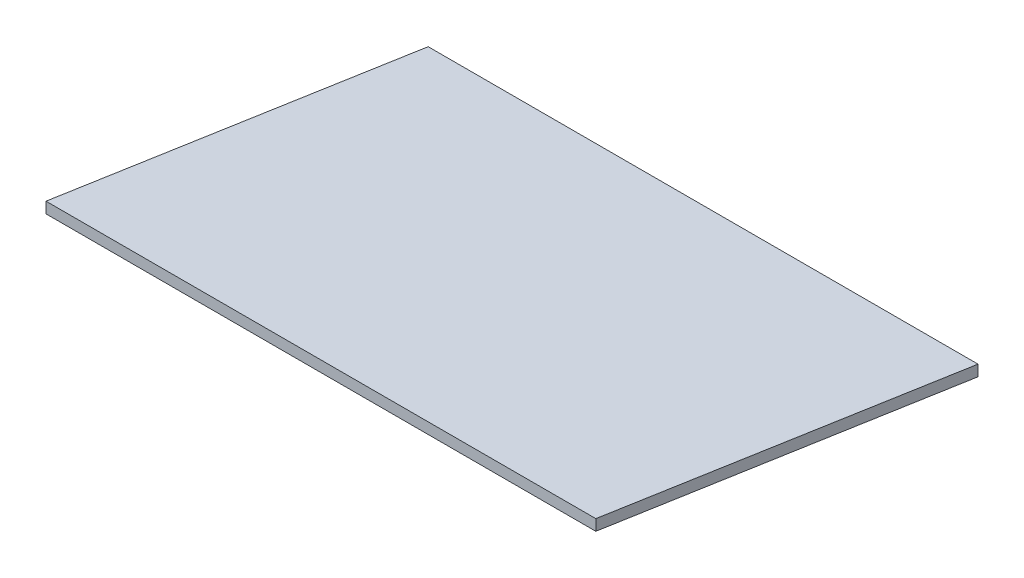
ISO-10303-21;
HEADER;
FILE_DESCRIPTION(('STEP AP214'),'2;1');
FILE_NAME('part.step','',(''),(''),'','','');
FILE_SCHEMA(('AUTOMOTIVE_DESIGN { 1 0 10303 214 1 1 1 1 }'));
ENDSEC;
DATA;
#1=APPLICATION_CONTEXT('core data for automotive mechanical design processes');
#2=APPLICATION_PROTOCOL_DEFINITION('international standard','automotive_design',2000,#1);
#3=PRODUCT_CONTEXT('',#1,'mechanical');
#4=PRODUCT('Part','Part','',(#3));
#5=PRODUCT_RELATED_PRODUCT_CATEGORY('part','',(#4));
#6=PRODUCT_DEFINITION_FORMATION('','',#4);
#7=PRODUCT_DEFINITION_CONTEXT('part definition',#1,'design');
#8=PRODUCT_DEFINITION('design','',#6,#7);
#9=PRODUCT_DEFINITION_SHAPE('','',#8);
#10=(LENGTH_UNIT() NAMED_UNIT(*) SI_UNIT(.MILLI.,.METRE.));
#11=(NAMED_UNIT(*) PLANE_ANGLE_UNIT() SI_UNIT($,.RADIAN.));
#12=(NAMED_UNIT(*) SI_UNIT($,.STERADIAN.) SOLID_ANGLE_UNIT());
#13=UNCERTAINTY_MEASURE_WITH_UNIT(LENGTH_MEASURE(1.E-05),#10,'distance_accuracy_value','');
#14=(GEOMETRIC_REPRESENTATION_CONTEXT(3) GLOBAL_UNCERTAINTY_ASSIGNED_CONTEXT((#13)) GLOBAL_UNIT_ASSIGNED_CONTEXT((#10,
#11,#12)) REPRESENTATION_CONTEXT('',''));
#15=CARTESIAN_POINT('',(0.,0.,0.));
#16=DIRECTION('',(0.,0.,1.));
#17=DIRECTION('',(1.,0.,0.));
#18=AXIS2_PLACEMENT_3D('',#15,#16,#17);
#19=CARTESIAN_POINT('',(0.,20.,0.));
#20=DIRECTION('',(0.,0.,-1.));
#21=DIRECTION('',(-1.,0.,0.));
#22=AXIS2_PLACEMENT_3D('',#19,#20,#21);
#23=PLANE('',#22);
#24=CARTESIAN_POINT('',(0.,0.,0.));
#25=CARTESIAN_POINT('',(200.,0.,0.));
#26=CARTESIAN_POINT('',(800.,0.,0.));
#27=CARTESIAN_POINT('',(1000.,0.,0.));
#28=B_SPLINE_CURVE_WITH_KNOTS('',3,(#24,#25,#26,#27),.UNSPECIFIED.,.F.,.F.,(4,4),(0.,1.),.UNSPECIFIED.);
#29=CARTESIAN_POINT('',(0.,0.,0.));
#30=VERTEX_POINT('',#29);
#31=CARTESIAN_POINT('',(1000.,0.,0.));
#32=VERTEX_POINT('',#31);
#33=EDGE_CURVE('E107',#30,#32,#28,.T.);
#34=ORIENTED_EDGE('',*,*,#33,.T.);
#35=DIRECTION('',(0.,-1.,0.));
#36=VECTOR('',#35,1.);
#37=CARTESIAN_POINT('',(1000.,20.,0.));
#38=LINE('',#37,#36);
#39=CARTESIAN_POINT('',(1000.,20.,0.));
#40=VERTEX_POINT('',#39);
#41=EDGE_CURVE('E11',#40,#32,#38,.T.);
#42=ORIENTED_EDGE('',*,*,#41,.F.);
#43=CARTESIAN_POINT('',(0.,20.,0.));
#44=CARTESIAN_POINT('',(200.,20.,0.));
#45=CARTESIAN_POINT('',(800.,20.,0.));
#46=CARTESIAN_POINT('',(1000.,20.,0.));
#47=B_SPLINE_CURVE_WITH_KNOTS('',3,(#43,#44,#45,#46),.UNSPECIFIED.,.F.,.F.,(4,4),(0.,1.),.UNSPECIFIED.);
#48=CARTESIAN_POINT('',(0.,20.,0.));
#49=VERTEX_POINT('',#48);
#50=EDGE_CURVE('E86',#49,#40,#47,.T.);
#51=ORIENTED_EDGE('',*,*,#50,.F.);
#52=DIRECTION('',(0.,-1.,0.));
#53=VECTOR('',#52,1.);
#54=CARTESIAN_POINT('',(0.,20.,0.));
#55=LINE('',#54,#53);
#56=EDGE_CURVE('E94',#49,#30,#55,.T.);
#57=ORIENTED_EDGE('',*,*,#56,.T.);
#58=EDGE_LOOP('',(#34,#42,#51,#57));
#59=FACE_BOUND('',#58,.T.);
#60=ADVANCED_FACE('F35',(#59),#23,.F.);
#61=CARTESIAN_POINT('',(1000.,20.,0.));
#62=DIRECTION('',(-0.984807753012209,0.,-0.173648177666927));
#63=DIRECTION('',(-0.173648177666927,0.,0.984807753012209));
#64=AXIS2_PLACEMENT_3D('',#61,#62,#63);
#65=PLANE('',#64);
#66=CARTESIAN_POINT('',(1000.,0.,0.));
#67=CARTESIAN_POINT('',(1104.18890660016,0.,-590.884651807325));
#68=B_SPLINE_CURVE_WITH_KNOTS('',1,(#66,#67),.UNSPECIFIED.,.F.,.F.,(2,2),(0.,1.),.UNSPECIFIED.);
#69=CARTESIAN_POINT('',(1104.18890660016,0.,-590.884651807325));
#70=VERTEX_POINT('',#69);
#71=EDGE_CURVE('E90',#32,#70,#68,.T.);
#72=ORIENTED_EDGE('',*,*,#71,.T.);
#73=DIRECTION('',(0.,-1.,0.));
#74=VECTOR('',#73,1.);
#75=CARTESIAN_POINT('',(1104.18890660016,20.,-590.884651807325));
#76=LINE('',#75,#74);
#77=CARTESIAN_POINT('',(1104.18890660016,20.,-590.884651807325));
#78=VERTEX_POINT('',#77);
#79=EDGE_CURVE('E43',#78,#70,#76,.T.);
#80=ORIENTED_EDGE('',*,*,#79,.F.);
#81=CARTESIAN_POINT('',(1000.,20.,0.));
#82=CARTESIAN_POINT('',(1104.18890660016,20.,-590.884651807325));
#83=B_SPLINE_CURVE_WITH_KNOTS('',1,(#81,#82),.UNSPECIFIED.,.F.,.F.,(2,2),(0.,1.),.UNSPECIFIED.);
#84=EDGE_CURVE('E81',#40,#78,#83,.T.);
#85=ORIENTED_EDGE('',*,*,#84,.F.);
#86=ORIENTED_EDGE('',*,*,#41,.T.);
#87=EDGE_LOOP('',(#72,#80,#85,#86));
#88=FACE_BOUND('',#87,.T.);
#89=ADVANCED_FACE('F89',(#88),#65,.F.);
#90=CARTESIAN_POINT('',(1104.18890660016,20.,-590.884651807325));
#91=DIRECTION('',(0.,0.,1.));
#92=DIRECTION('',(1.,0.,0.));
#93=AXIS2_PLACEMENT_3D('',#90,#91,#92);
#94=PLANE('',#93);
#95=CARTESIAN_POINT('',(1104.18890660016,0.,-590.884651807325));
#96=CARTESIAN_POINT('',(804.188906600156,0.,-590.884651807325));
#97=CARTESIAN_POINT('',(104.188906600156,0.,-590.884651807325));
#98=B_SPLINE_CURVE_WITH_KNOTS('',2,(#95,#96,#97),.UNSPECIFIED.,.F.,.F.,(3,3),(0.,1.),.UNSPECIFIED.);
#99=CARTESIAN_POINT('',(104.188906600156,0.,-590.884651807325));
#100=VERTEX_POINT('',#99);
#101=EDGE_CURVE('E68',#70,#100,#98,.T.);
#102=ORIENTED_EDGE('',*,*,#101,.T.);
#103=DIRECTION('',(0.,-1.,0.));
#104=VECTOR('',#103,1.);
#105=CARTESIAN_POINT('',(104.188906600156,20.,-590.884651807325));
#106=LINE('',#105,#104);
#107=CARTESIAN_POINT('',(104.188906600156,20.,-590.884651807325));
#108=VERTEX_POINT('',#107);
#109=EDGE_CURVE('E91',#108,#100,#106,.T.);
#110=ORIENTED_EDGE('',*,*,#109,.F.);
#111=CARTESIAN_POINT('',(1104.18890660016,20.,-590.884651807325));
#112=CARTESIAN_POINT('',(804.188906600156,20.,-590.884651807325));
#113=CARTESIAN_POINT('',(104.188906600156,20.,-590.884651807325));
#114=B_SPLINE_CURVE_WITH_KNOTS('',2,(#111,#112,#113),.UNSPECIFIED.,.F.,.F.,(3,3),(0.,1.),.UNSPECIFIED.);
#115=EDGE_CURVE('E84',#78,#108,#114,.T.);
#116=ORIENTED_EDGE('',*,*,#115,.F.);
#117=ORIENTED_EDGE('',*,*,#79,.T.);
#118=EDGE_LOOP('',(#102,#110,#116,#117));
#119=FACE_BOUND('',#118,.T.);
#120=ADVANCED_FACE('F92',(#119),#94,.F.);
#121=CARTESIAN_POINT('',(104.188906600156,20.,-590.884651807325));
#122=DIRECTION('',(0.984807753012209,0.,0.173648177666927));
#123=DIRECTION('',(0.173648177666927,0.,-0.984807753012209));
#124=AXIS2_PLACEMENT_3D('',#121,#122,#123);
#125=PLANE('',#124);
#126=CARTESIAN_POINT('',(104.188906600156,0.,-590.884651807325));
#127=CARTESIAN_POINT('',(0.,0.,0.));
#128=B_SPLINE_CURVE_WITH_KNOTS('',1,(#126,#127),.UNSPECIFIED.,.F.,.F.,(2,2),(0.,1.),.UNSPECIFIED.);
#129=EDGE_CURVE('E74',#100,#30,#128,.T.);
#130=ORIENTED_EDGE('',*,*,#129,.T.);
#131=ORIENTED_EDGE('',*,*,#56,.F.);
#132=CARTESIAN_POINT('',(104.188906600156,20.,-590.884651807325));
#133=CARTESIAN_POINT('',(0.,20.,0.));
#134=B_SPLINE_CURVE_WITH_KNOTS('',1,(#132,#133),.UNSPECIFIED.,.F.,.F.,(2,2),(0.,1.),.UNSPECIFIED.);
#135=EDGE_CURVE('E51',#108,#49,#134,.T.);
#136=ORIENTED_EDGE('',*,*,#135,.F.);
#137=ORIENTED_EDGE('',*,*,#109,.T.);
#138=EDGE_LOOP('',(#130,#131,#136,#137));
#139=FACE_BOUND('',#138,.T.);
#140=ADVANCED_FACE('F137',(#139),#125,.F.);
#141=CARTESIAN_POINT('',(500.,20.,0.));
#142=DIRECTION('',(0.,1.,0.));
#143=DIRECTION('',(0.,0.,1.));
#144=AXIS2_PLACEMENT_3D('',#141,#142,#143);
#145=PLANE('',#144);
#146=ORIENTED_EDGE('',*,*,#50,.T.);
#147=ORIENTED_EDGE('',*,*,#84,.T.);
#148=ORIENTED_EDGE('',*,*,#115,.T.);
#149=ORIENTED_EDGE('',*,*,#135,.T.);
#150=EDGE_LOOP('',(#146,#147,#148,#149));
#151=FACE_BOUND('',#150,.T.);
#152=ADVANCED_FACE('F82',(#151),#145,.T.);
#153=CARTESIAN_POINT('',(500.,0.,0.));
#154=DIRECTION('',(0.,1.,0.));
#155=DIRECTION('',(0.,0.,1.));
#156=AXIS2_PLACEMENT_3D('',#153,#154,#155);
#157=PLANE('',#156);
#158=ORIENTED_EDGE('',*,*,#33,.F.);
#159=ORIENTED_EDGE('',*,*,#129,.F.);
#160=ORIENTED_EDGE('',*,*,#101,.F.);
#161=ORIENTED_EDGE('',*,*,#71,.F.);
#162=EDGE_LOOP('',(#158,#159,#160,#161));
#163=FACE_BOUND('',#162,.T.);
#164=ADVANCED_FACE('F140',(#163),#157,.F.);
#165=CLOSED_SHELL('',(#60,#89,#120,#140,#152,#164));
#166=MANIFOLD_SOLID_BREP('B2',#165);
#167=ADVANCED_BREP_SHAPE_REPRESENTATION('',(#18,#166),#14);
#168=SHAPE_DEFINITION_REPRESENTATION(#9,#167);
ENDSEC;
END-ISO-10303-21;
